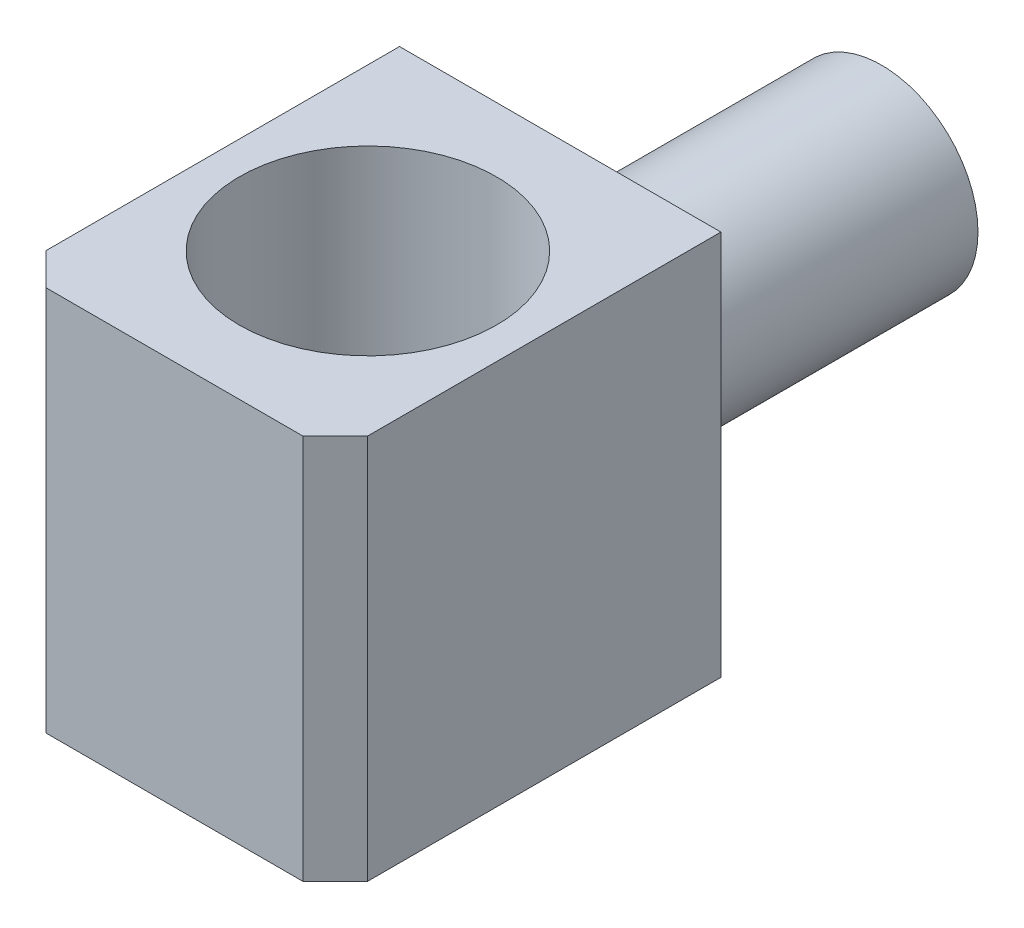
ISO-10303-21;
HEADER;
FILE_DESCRIPTION(('STEP AP214'),'2;1');
FILE_NAME('part.step','',(''),(''),'','','');
FILE_SCHEMA(('AUTOMOTIVE_DESIGN { 1 0 10303 214 1 1 1 1 }'));
ENDSEC;
DATA;
#1=APPLICATION_CONTEXT('core data for automotive mechanical design processes');
#2=APPLICATION_PROTOCOL_DEFINITION('international standard','automotive_design',2000,#1);
#3=PRODUCT_CONTEXT('',#1,'mechanical');
#4=PRODUCT('Part','Part','',(#3));
#5=PRODUCT_RELATED_PRODUCT_CATEGORY('part','',(#4));
#6=PRODUCT_DEFINITION_FORMATION('','',#4);
#7=PRODUCT_DEFINITION_CONTEXT('part definition',#1,'design');
#8=PRODUCT_DEFINITION('design','',#6,#7);
#9=PRODUCT_DEFINITION_SHAPE('','',#8);
#10=(LENGTH_UNIT() NAMED_UNIT(*) SI_UNIT(.MILLI.,.METRE.));
#11=(NAMED_UNIT(*) PLANE_ANGLE_UNIT() SI_UNIT($,.RADIAN.));
#12=(NAMED_UNIT(*) SI_UNIT($,.STERADIAN.) SOLID_ANGLE_UNIT());
#13=UNCERTAINTY_MEASURE_WITH_UNIT(LENGTH_MEASURE(1.E-05),#10,'distance_accuracy_value','');
#14=(GEOMETRIC_REPRESENTATION_CONTEXT(3) GLOBAL_UNCERTAINTY_ASSIGNED_CONTEXT((#13)) GLOBAL_UNIT_ASSIGNED_CONTEXT((#10,
#11,#12)) REPRESENTATION_CONTEXT('',''));
#15=CARTESIAN_POINT('',(0.,0.,0.));
#16=DIRECTION('',(0.,0.,1.));
#17=DIRECTION('',(1.,0.,0.));
#18=AXIS2_PLACEMENT_3D('',#15,#16,#17);
#19=CARTESIAN_POINT('',(0.,12.,0.));
#20=DIRECTION('',(0.,1.,0.));
#21=DIRECTION('',(0.,0.,1.));
#22=AXIS2_PLACEMENT_3D('',#19,#20,#21);
#23=PLANE('',#22);
#24=DIRECTION('',(1.,0.,0.));
#25=VECTOR('',#24,1.);
#26=CARTESIAN_POINT('',(0.,12.,12.));
#27=LINE('',#26,#25);
#28=CARTESIAN_POINT('',(1.,12.,12.));
#29=VERTEX_POINT('',#28);
#30=CARTESIAN_POINT('',(8.99999999999999,12.,12.));
#31=VERTEX_POINT('',#30);
#32=EDGE_CURVE('E110',#29,#31,#27,.T.);
#33=ORIENTED_EDGE('',*,*,#32,.T.);
#34=DIRECTION('',(-0.707106781186549,0.,0.707106781186546));
#35=VECTOR('',#34,1.);
#36=CARTESIAN_POINT('',(10.5,12.,10.5));
#37=LINE('',#36,#35);
#38=CARTESIAN_POINT('',(10.,12.,11.));
#39=VERTEX_POINT('',#38);
#40=EDGE_CURVE('E143',#31,#39,#37,.F.);
#41=ORIENTED_EDGE('',*,*,#40,.T.);
#42=DIRECTION('',(0.,0.,-1.));
#43=VECTOR('',#42,1.);
#44=CARTESIAN_POINT('',(10.,12.,12.));
#45=LINE('',#44,#43);
#46=CARTESIAN_POINT('',(10.,12.,0.));
#47=VERTEX_POINT('',#46);
#48=EDGE_CURVE('E116',#39,#47,#45,.T.);
#49=ORIENTED_EDGE('',*,*,#48,.T.);
#50=DIRECTION('',(-1.,0.,0.));
#51=VECTOR('',#50,1.);
#52=CARTESIAN_POINT('',(10.,12.,0.));
#53=LINE('',#52,#51);
#54=CARTESIAN_POINT('',(0.,12.,0.));
#55=VERTEX_POINT('',#54);
#56=EDGE_CURVE('E111',#47,#55,#53,.T.);
#57=ORIENTED_EDGE('',*,*,#56,.T.);
#58=DIRECTION('',(0.,0.,1.));
#59=VECTOR('',#58,1.);
#60=CARTESIAN_POINT('',(0.,12.,0.));
#61=LINE('',#60,#59);
#62=CARTESIAN_POINT('',(0.,12.,11.));
#63=VERTEX_POINT('',#62);
#64=EDGE_CURVE('E102',#55,#63,#61,.T.);
#65=ORIENTED_EDGE('',*,*,#64,.T.);
#66=DIRECTION('',(-0.707106781186546,0.,-0.707106781186549));
#67=VECTOR('',#66,1.);
#68=CARTESIAN_POINT('',(-5.5,12.,5.49999999999998));
#69=LINE('',#68,#67);
#70=EDGE_CURVE('E141',#63,#29,#69,.F.);
#71=ORIENTED_EDGE('',*,*,#70,.T.);
#72=EDGE_LOOP('',(#33,#41,#49,#57,#65,#71));
#73=FACE_BOUND('',#72,.T.);
#74=CARTESIAN_POINT('',(5.01657356077359,12.,6.));
#75=DIRECTION('',(0.,1.,0.));
#76=DIRECTION('',(0.,0.,1.));
#77=AXIS2_PLACEMENT_3D('',#74,#75,#76);
#78=CIRCLE('',#77,4.);
#79=CARTESIAN_POINT('',(5.01657356077359,12.,10.));
#80=VERTEX_POINT('',#79);
#81=EDGE_CURVE('E163',#80,#80,#78,.T.);
#82=ORIENTED_EDGE('',*,*,#81,.F.);
#83=EDGE_LOOP('',(#82));
#84=FACE_BOUND('',#83,.T.);
#85=ADVANCED_FACE('F49',(#73,#84),#23,.T.);
#86=CARTESIAN_POINT('',(0.,0.,0.));
#87=DIRECTION('',(0.,1.,0.));
#88=DIRECTION('',(0.,0.,1.));
#89=AXIS2_PLACEMENT_3D('',#86,#87,#88);
#90=PLANE('',#89);
#91=DIRECTION('',(0.,0.,-1.));
#92=VECTOR('',#91,1.);
#93=CARTESIAN_POINT('',(10.,0.,12.));
#94=LINE('',#93,#92);
#95=CARTESIAN_POINT('',(10.,0.,11.));
#96=VERTEX_POINT('',#95);
#97=CARTESIAN_POINT('',(10.,0.,0.));
#98=VERTEX_POINT('',#97);
#99=EDGE_CURVE('E120',#96,#98,#94,.T.);
#100=ORIENTED_EDGE('',*,*,#99,.F.);
#101=DIRECTION('',(0.707106781186549,0.,-0.707106781186546));
#102=VECTOR('',#101,1.);
#103=CARTESIAN_POINT('',(10.,0.,11.));
#104=LINE('',#103,#102);
#105=CARTESIAN_POINT('',(9.,0.,12.));
#106=VERTEX_POINT('',#105);
#107=EDGE_CURVE('E135',#96,#106,#104,.F.);
#108=ORIENTED_EDGE('',*,*,#107,.T.);
#109=DIRECTION('',(1.,0.,0.));
#110=VECTOR('',#109,1.);
#111=CARTESIAN_POINT('',(0.,0.,12.));
#112=LINE('',#111,#110);
#113=CARTESIAN_POINT('',(1.,0.,12.));
#114=VERTEX_POINT('',#113);
#115=EDGE_CURVE('E156',#114,#106,#112,.T.);
#116=ORIENTED_EDGE('',*,*,#115,.F.);
#117=DIRECTION('',(0.707106781186546,0.,0.707106781186549));
#118=VECTOR('',#117,1.);
#119=CARTESIAN_POINT('',(1.,0.,12.));
#120=LINE('',#119,#118);
#121=CARTESIAN_POINT('',(0.,0.,11.));
#122=VERTEX_POINT('',#121);
#123=EDGE_CURVE('E129',#114,#122,#120,.F.);
#124=ORIENTED_EDGE('',*,*,#123,.T.);
#125=DIRECTION('',(0.,0.,1.));
#126=VECTOR('',#125,1.);
#127=CARTESIAN_POINT('',(0.,0.,0.));
#128=LINE('',#127,#126);
#129=CARTESIAN_POINT('',(0.,0.,0.));
#130=VERTEX_POINT('',#129);
#131=EDGE_CURVE('E159',#130,#122,#128,.T.);
#132=ORIENTED_EDGE('',*,*,#131,.F.);
#133=DIRECTION('',(-1.,0.,0.));
#134=VECTOR('',#133,1.);
#135=CARTESIAN_POINT('',(10.,0.,0.));
#136=LINE('',#135,#134);
#137=EDGE_CURVE('E124',#98,#130,#136,.T.);
#138=ORIENTED_EDGE('',*,*,#137,.F.);
#139=EDGE_LOOP('',(#100,#108,#116,#124,#132,#138));
#140=FACE_BOUND('',#139,.T.);
#141=CARTESIAN_POINT('',(5.01657356077359,0.,6.));
#142=DIRECTION('',(0.,1.,0.));
#143=DIRECTION('',(0.,0.,1.));
#144=AXIS2_PLACEMENT_3D('',#141,#142,#143);
#145=CIRCLE('',#144,4.);
#146=CARTESIAN_POINT('',(5.01657356077359,0.,10.));
#147=VERTEX_POINT('',#146);
#148=EDGE_CURVE('E166',#147,#147,#145,.T.);
#149=ORIENTED_EDGE('',*,*,#148,.T.);
#150=EDGE_LOOP('',(#149));
#151=FACE_BOUND('',#150,.T.);
#152=ADVANCED_FACE('F154',(#140,#151),#90,.F.);
#153=CARTESIAN_POINT('',(10.,12.,0.));
#154=DIRECTION('',(0.,0.,1.));
#155=DIRECTION('',(1.,0.,0.));
#156=AXIS2_PLACEMENT_3D('',#153,#154,#155);
#157=PLANE('',#156);
#158=CARTESIAN_POINT('',(5.,6.,0.));
#159=DIRECTION('',(0.,0.,1.));
#160=DIRECTION('',(1.,0.,0.));
#161=AXIS2_PLACEMENT_3D('',#158,#159,#160);
#162=CIRCLE('',#161,3.);
#163=CARTESIAN_POINT('',(8.,6.,0.));
#164=VERTEX_POINT('',#163);
#165=EDGE_CURVE('E13',#164,#164,#162,.F.);
#166=ORIENTED_EDGE('',*,*,#165,.F.);
#167=EDGE_LOOP('',(#166));
#168=FACE_BOUND('',#167,.T.);
#169=ORIENTED_EDGE('',*,*,#137,.T.);
#170=DIRECTION('',(0.,-1.,0.));
#171=VECTOR('',#170,1.);
#172=CARTESIAN_POINT('',(0.,12.,0.));
#173=LINE('',#172,#171);
#174=EDGE_CURVE('E106',#55,#130,#173,.T.);
#175=ORIENTED_EDGE('',*,*,#174,.F.);
#176=ORIENTED_EDGE('',*,*,#56,.F.);
#177=DIRECTION('',(0.,-1.,0.));
#178=VECTOR('',#177,1.);
#179=CARTESIAN_POINT('',(10.,12.,0.));
#180=LINE('',#179,#178);
#181=EDGE_CURVE('E126',#47,#98,#180,.T.);
#182=ORIENTED_EDGE('',*,*,#181,.T.);
#183=EDGE_LOOP('',(#169,#175,#176,#182));
#184=FACE_BOUND('',#183,.T.);
#185=ADVANCED_FACE('F122',(#168,#184),#157,.F.);
#186=CARTESIAN_POINT('',(0.,12.,0.));
#187=DIRECTION('',(1.,0.,0.));
#188=DIRECTION('',(0.,0.,-1.));
#189=AXIS2_PLACEMENT_3D('',#186,#187,#188);
#190=PLANE('',#189);
#191=ORIENTED_EDGE('',*,*,#131,.T.);
#192=DIRECTION('',(0.,1.,0.));
#193=VECTOR('',#192,1.);
#194=CARTESIAN_POINT('',(0.,12.,11.));
#195=LINE('',#194,#193);
#196=EDGE_CURVE('E57',#122,#63,#195,.T.);
#197=ORIENTED_EDGE('',*,*,#196,.T.);
#198=ORIENTED_EDGE('',*,*,#64,.F.);
#199=ORIENTED_EDGE('',*,*,#174,.T.);
#200=EDGE_LOOP('',(#191,#197,#198,#199));
#201=FACE_BOUND('',#200,.T.);
#202=ADVANCED_FACE('F104',(#201),#190,.F.);
#203=CARTESIAN_POINT('',(0.,12.,12.));
#204=DIRECTION('',(0.,0.,-1.));
#205=DIRECTION('',(-1.,0.,0.));
#206=AXIS2_PLACEMENT_3D('',#203,#204,#205);
#207=PLANE('',#206);
#208=ORIENTED_EDGE('',*,*,#115,.T.);
#209=DIRECTION('',(0.,1.,0.));
#210=VECTOR('',#209,1.);
#211=CARTESIAN_POINT('',(9.,12.,12.));
#212=LINE('',#211,#210);
#213=EDGE_CURVE('E71',#106,#31,#212,.T.);
#214=ORIENTED_EDGE('',*,*,#213,.T.);
#215=ORIENTED_EDGE('',*,*,#32,.F.);
#216=DIRECTION('',(0.,-1.,0.));
#217=VECTOR('',#216,1.);
#218=CARTESIAN_POINT('',(1.,12.,12.));
#219=LINE('',#218,#217);
#220=EDGE_CURVE('E137',#29,#114,#219,.T.);
#221=ORIENTED_EDGE('',*,*,#220,.T.);
#222=EDGE_LOOP('',(#208,#214,#215,#221));
#223=FACE_BOUND('',#222,.T.);
#224=ADVANCED_FACE('F157',(#223),#207,.F.);
#225=CARTESIAN_POINT('',(10.,12.,12.));
#226=DIRECTION('',(-1.,0.,0.));
#227=DIRECTION('',(0.,0.,1.));
#228=AXIS2_PLACEMENT_3D('',#225,#226,#227);
#229=PLANE('',#228);
#230=ORIENTED_EDGE('',*,*,#48,.F.);
#231=DIRECTION('',(0.,-1.,0.));
#232=VECTOR('',#231,1.);
#233=CARTESIAN_POINT('',(10.,12.,11.));
#234=LINE('',#233,#232);
#235=EDGE_CURVE('E125',#39,#96,#234,.T.);
#236=ORIENTED_EDGE('',*,*,#235,.T.);
#237=ORIENTED_EDGE('',*,*,#99,.T.);
#238=ORIENTED_EDGE('',*,*,#181,.F.);
#239=EDGE_LOOP('',(#230,#236,#237,#238));
#240=FACE_BOUND('',#239,.T.);
#241=ADVANCED_FACE('F148',(#240),#229,.F.);
#242=CARTESIAN_POINT('',(5.01657356077359,12.,6.));
#243=DIRECTION('',(0.,-1.,0.));
#244=DIRECTION('',(0.,0.,-1.));
#245=AXIS2_PLACEMENT_3D('',#242,#243,#244);
#246=CYLINDRICAL_SURFACE('',#245,4.);
#247=ORIENTED_EDGE('',*,*,#81,.T.);
#248=EDGE_LOOP('',(#247));
#249=FACE_BOUND('',#248,.T.);
#250=ORIENTED_EDGE('',*,*,#148,.F.);
#251=EDGE_LOOP('',(#250));
#252=FACE_BOUND('',#251,.T.);
#253=ADVANCED_FACE('F196',(#249,#252),#246,.F.);
#254=CARTESIAN_POINT('',(10.,12.,11.));
#255=DIRECTION('',(-0.707106781186546,0.,-0.707106781186549));
#256=DIRECTION('',(0.,-1.,0.));
#257=AXIS2_PLACEMENT_3D('',#254,#255,#256);
#258=PLANE('',#257);
#259=ORIENTED_EDGE('',*,*,#40,.F.);
#260=ORIENTED_EDGE('',*,*,#213,.F.);
#261=ORIENTED_EDGE('',*,*,#107,.F.);
#262=ORIENTED_EDGE('',*,*,#235,.F.);
#263=EDGE_LOOP('',(#259,#260,#261,#262));
#264=FACE_BOUND('',#263,.T.);
#265=ADVANCED_FACE('F151',(#264),#258,.F.);
#266=CARTESIAN_POINT('',(1.,12.,12.));
#267=DIRECTION('',(0.707106781186549,0.,-0.707106781186546));
#268=DIRECTION('',(0.,-1.,0.));
#269=AXIS2_PLACEMENT_3D('',#266,#267,#268);
#270=PLANE('',#269);
#271=ORIENTED_EDGE('',*,*,#70,.F.);
#272=ORIENTED_EDGE('',*,*,#196,.F.);
#273=ORIENTED_EDGE('',*,*,#123,.F.);
#274=ORIENTED_EDGE('',*,*,#220,.F.);
#275=EDGE_LOOP('',(#271,#272,#273,#274));
#276=FACE_BOUND('',#275,.T.);
#277=ADVANCED_FACE('F51',(#276),#270,.F.);
#278=CARTESIAN_POINT('',(5.00000000000001,6.,-9.99999999999999));
#279=DIRECTION('',(0.,0.,1.));
#280=DIRECTION('',(1.,0.,0.));
#281=AXIS2_PLACEMENT_3D('',#278,#279,#280);
#282=CYLINDRICAL_SURFACE('',#281,3.);
#283=CARTESIAN_POINT('',(5.00000000000001,6.,-9.99999999999999));
#284=DIRECTION('',(0.,0.,-1.));
#285=DIRECTION('',(-1.,0.,0.));
#286=AXIS2_PLACEMENT_3D('',#283,#284,#285);
#287=CIRCLE('',#286,3.);
#288=CARTESIAN_POINT('',(2.00000000000001,6.,-10.));
#289=VERTEX_POINT('',#288);
#290=EDGE_CURVE('E169',#289,#289,#287,.T.);
#291=ORIENTED_EDGE('',*,*,#290,.F.);
#292=EDGE_LOOP('',(#291));
#293=FACE_BOUND('',#292,.T.);
#294=ORIENTED_EDGE('',*,*,#165,.T.);
#295=EDGE_LOOP('',(#294));
#296=FACE_BOUND('',#295,.T.);
#297=ADVANCED_FACE('F177',(#293,#296),#282,.T.);
#298=CARTESIAN_POINT('',(5.00000000000001,6.,-9.99999999999999));
#299=DIRECTION('',(0.,0.,-1.));
#300=DIRECTION('',(-1.,0.,0.));
#301=AXIS2_PLACEMENT_3D('',#298,#299,#300);
#302=PLANE('',#301);
#303=ORIENTED_EDGE('',*,*,#290,.T.);
#304=EDGE_LOOP('',(#303));
#305=FACE_BOUND('',#304,.T.);
#306=ADVANCED_FACE('F175',(#305),#302,.T.);
#307=CLOSED_SHELL('',(#85,#152,#185,#202,#224,#241,#253,#265,#277,#297,#306));
#308=MANIFOLD_SOLID_BREP('B2',#307);
#309=ADVANCED_BREP_SHAPE_REPRESENTATION('',(#18,#308),#14);
#310=SHAPE_DEFINITION_REPRESENTATION(#9,#309);
ENDSEC;
END-ISO-10303-21;
